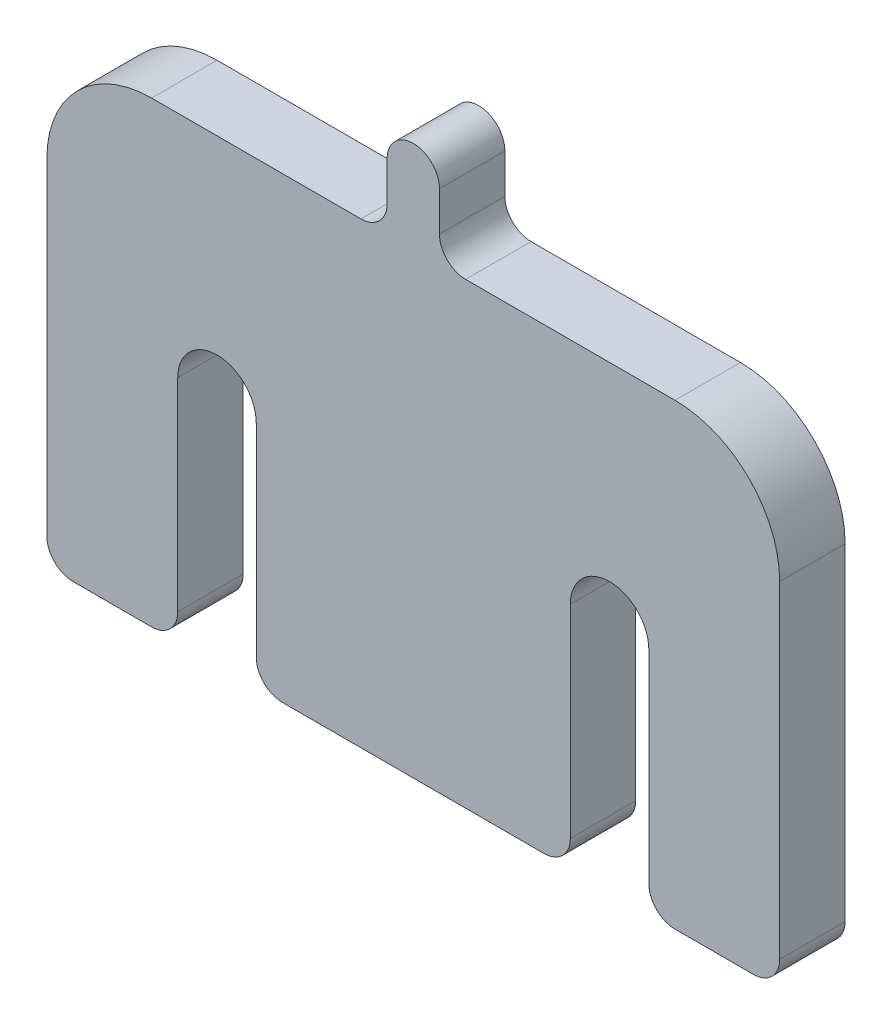
ISO-10303-21;
HEADER;
FILE_DESCRIPTION(('STEP AP214'),'2;1');
FILE_NAME('part.step','',(''),(''),'','','');
FILE_SCHEMA(('AUTOMOTIVE_DESIGN { 1 0 10303 214 1 1 1 1 }'));
ENDSEC;
DATA;
#1=APPLICATION_CONTEXT('core data for automotive mechanical design processes');
#2=APPLICATION_PROTOCOL_DEFINITION('international standard','automotive_design',2000,#1);
#3=PRODUCT_CONTEXT('',#1,'mechanical');
#4=PRODUCT('Part','Part','',(#3));
#5=PRODUCT_RELATED_PRODUCT_CATEGORY('part','',(#4));
#6=PRODUCT_DEFINITION_FORMATION('','',#4);
#7=PRODUCT_DEFINITION_CONTEXT('part definition',#1,'design');
#8=PRODUCT_DEFINITION('design','',#6,#7);
#9=PRODUCT_DEFINITION_SHAPE('','',#8);
#10=(LENGTH_UNIT() NAMED_UNIT(*) SI_UNIT(.MILLI.,.METRE.));
#11=(NAMED_UNIT(*) PLANE_ANGLE_UNIT() SI_UNIT($,.RADIAN.));
#12=(NAMED_UNIT(*) SI_UNIT($,.STERADIAN.) SOLID_ANGLE_UNIT());
#13=UNCERTAINTY_MEASURE_WITH_UNIT(LENGTH_MEASURE(1.E-05),#10,'distance_accuracy_value','');
#14=(GEOMETRIC_REPRESENTATION_CONTEXT(3) GLOBAL_UNCERTAINTY_ASSIGNED_CONTEXT((#13)) GLOBAL_UNIT_ASSIGNED_CONTEXT((#10,
#11,#12)) REPRESENTATION_CONTEXT('',''));
#15=CARTESIAN_POINT('',(0.,0.,0.));
#16=DIRECTION('',(0.,0.,1.));
#17=DIRECTION('',(1.,0.,0.));
#18=AXIS2_PLACEMENT_3D('',#15,#16,#17);
#19=CARTESIAN_POINT('',(15.,0.,5.));
#20=DIRECTION('',(0.,0.,-1.));
#21=DIRECTION('',(-1.,0.,0.));
#22=AXIS2_PLACEMENT_3D('',#19,#20,#21);
#23=CYLINDRICAL_SURFACE('',#22,3.);
#24=CARTESIAN_POINT('',(15.,0.,0.));
#25=DIRECTION('',(0.,0.,1.));
#26=DIRECTION('',(1.,0.,0.));
#27=AXIS2_PLACEMENT_3D('',#24,#25,#26);
#28=CIRCLE('',#27,3.);
#29=CARTESIAN_POINT('',(18.,0.,0.));
#30=VERTEX_POINT('',#29);
#31=CARTESIAN_POINT('',(12.,0.,0.));
#32=VERTEX_POINT('',#31);
#33=EDGE_CURVE('E215',#30,#32,#28,.T.);
#34=ORIENTED_EDGE('',*,*,#33,.F.);
#35=DIRECTION('',(0.,0.,-1.));
#36=VECTOR('',#35,1.);
#37=CARTESIAN_POINT('',(18.,0.,5.));
#38=LINE('',#37,#36);
#39=CARTESIAN_POINT('',(18.,0.,5.));
#40=VERTEX_POINT('',#39);
#41=EDGE_CURVE('E209',#40,#30,#38,.T.);
#42=ORIENTED_EDGE('',*,*,#41,.F.);
#43=CARTESIAN_POINT('',(15.,0.,5.));
#44=DIRECTION('',(0.,0.,1.));
#45=DIRECTION('',(1.,0.,0.));
#46=AXIS2_PLACEMENT_3D('',#43,#44,#45);
#47=CIRCLE('',#46,3.);
#48=CARTESIAN_POINT('',(12.,0.,5.));
#49=VERTEX_POINT('',#48);
#50=EDGE_CURVE('E212',#40,#49,#47,.T.);
#51=ORIENTED_EDGE('',*,*,#50,.T.);
#52=DIRECTION('',(0.,0.,-1.));
#53=VECTOR('',#52,1.);
#54=CARTESIAN_POINT('',(12.,0.,5.));
#55=LINE('',#54,#53);
#56=EDGE_CURVE('E270',#49,#32,#55,.T.);
#57=ORIENTED_EDGE('',*,*,#56,.T.);
#58=EDGE_LOOP('',(#34,#42,#51,#57));
#59=FACE_BOUND('',#58,.T.);
#60=ADVANCED_FACE('F36',(#59),#23,.F.);
#61=CARTESIAN_POINT('',(18.,0.,5.));
#62=DIRECTION('',(1.,0.,0.));
#63=DIRECTION('',(0.,1.,0.));
#64=AXIS2_PLACEMENT_3D('',#61,#62,#63);
#65=PLANE('',#64);
#66=DIRECTION('',(0.,-1.,0.));
#67=VECTOR('',#66,1.);
#68=CARTESIAN_POINT('',(18.,0.,0.));
#69=LINE('',#68,#67);
#70=CARTESIAN_POINT('',(18.,-15.5,0.));
#71=VERTEX_POINT('',#70);
#72=EDGE_CURVE('E272',#30,#71,#69,.T.);
#73=ORIENTED_EDGE('',*,*,#72,.T.);
#74=DIRECTION('',(0.,0.,-1.));
#75=VECTOR('',#74,1.);
#76=CARTESIAN_POINT('',(18.,-15.5,5.));
#77=LINE('',#76,#75);
#78=CARTESIAN_POINT('',(18.,-15.5,5.));
#79=VERTEX_POINT('',#78);
#80=EDGE_CURVE('E226',#71,#79,#77,.F.);
#81=ORIENTED_EDGE('',*,*,#80,.T.);
#82=DIRECTION('',(0.,-1.,0.));
#83=VECTOR('',#82,1.);
#84=CARTESIAN_POINT('',(18.,0.,5.));
#85=LINE('',#84,#83);
#86=EDGE_CURVE('E223',#40,#79,#85,.T.);
#87=ORIENTED_EDGE('',*,*,#86,.F.);
#88=ORIENTED_EDGE('',*,*,#41,.T.);
#89=EDGE_LOOP('',(#73,#81,#87,#88));
#90=FACE_BOUND('',#89,.T.);
#91=ADVANCED_FACE('F224',(#90),#65,.F.);
#92=CARTESIAN_POINT('',(0.,-17.5,5.));
#93=DIRECTION('',(0.,-1.,0.));
#94=DIRECTION('',(1.,0.,0.));
#95=AXIS2_PLACEMENT_3D('',#92,#93,#94);
#96=PLANE('',#95);
#97=DIRECTION('',(-1.,0.,0.));
#98=VECTOR('',#97,1.);
#99=CARTESIAN_POINT('',(0.,-17.5,5.));
#100=LINE('',#99,#98);
#101=CARTESIAN_POINT('',(26.,-17.5,5.));
#102=VERTEX_POINT('',#101);
#103=CARTESIAN_POINT('',(20.,-17.5,5.));
#104=VERTEX_POINT('',#103);
#105=EDGE_CURVE('E228',#102,#104,#100,.T.);
#106=ORIENTED_EDGE('',*,*,#105,.T.);
#107=DIRECTION('',(0.,0.,-1.));
#108=VECTOR('',#107,1.);
#109=CARTESIAN_POINT('',(20.,-17.5,0.));
#110=LINE('',#109,#108);
#111=CARTESIAN_POINT('',(20.,-17.5,0.));
#112=VERTEX_POINT('',#111);
#113=EDGE_CURVE('E366',#104,#112,#110,.T.);
#114=ORIENTED_EDGE('',*,*,#113,.T.);
#115=DIRECTION('',(-1.,0.,0.));
#116=VECTOR('',#115,1.);
#117=CARTESIAN_POINT('',(0.,-17.5,0.));
#118=LINE('',#117,#116);
#119=CARTESIAN_POINT('',(26.,-17.5,0.));
#120=VERTEX_POINT('',#119);
#121=EDGE_CURVE('E274',#120,#112,#118,.T.);
#122=ORIENTED_EDGE('',*,*,#121,.F.);
#123=DIRECTION('',(0.,0.,-1.));
#124=VECTOR('',#123,1.);
#125=CARTESIAN_POINT('',(26.,-17.5,5.));
#126=LINE('',#125,#124);
#127=EDGE_CURVE('E364',#120,#102,#126,.F.);
#128=ORIENTED_EDGE('',*,*,#127,.T.);
#129=EDGE_LOOP('',(#106,#114,#122,#128));
#130=FACE_BOUND('',#129,.T.);
#131=ADVANCED_FACE('F474',(#130),#96,.T.);
#132=CARTESIAN_POINT('',(28.,0.,5.));
#133=DIRECTION('',(-1.,0.,0.));
#134=DIRECTION('',(0.,0.,1.));
#135=AXIS2_PLACEMENT_3D('',#132,#133,#134);
#136=PLANE('',#135);
#137=DIRECTION('',(0.,1.,0.));
#138=VECTOR('',#137,1.);
#139=CARTESIAN_POINT('',(28.,0.,0.));
#140=LINE('',#139,#138);
#141=CARTESIAN_POINT('',(28.,-15.5,0.));
#142=VERTEX_POINT('',#141);
#143=CARTESIAN_POINT('',(28.,9.5,0.));
#144=VERTEX_POINT('',#143);
#145=EDGE_CURVE('E277',#142,#144,#140,.T.);
#146=ORIENTED_EDGE('',*,*,#145,.T.);
#147=DIRECTION('',(0.,0.,-1.));
#148=VECTOR('',#147,1.);
#149=CARTESIAN_POINT('',(28.,9.5,5.));
#150=LINE('',#149,#148);
#151=CARTESIAN_POINT('',(28.,9.5,5.));
#152=VERTEX_POINT('',#151);
#153=EDGE_CURVE('E11',#144,#152,#150,.F.);
#154=ORIENTED_EDGE('',*,*,#153,.T.);
#155=DIRECTION('',(0.,1.,0.));
#156=VECTOR('',#155,1.);
#157=CARTESIAN_POINT('',(28.,0.,5.));
#158=LINE('',#157,#156);
#159=CARTESIAN_POINT('',(28.,-15.5,5.));
#160=VERTEX_POINT('',#159);
#161=EDGE_CURVE('E245',#160,#152,#158,.T.);
#162=ORIENTED_EDGE('',*,*,#161,.F.);
#163=DIRECTION('',(0.,0.,-1.));
#164=VECTOR('',#163,1.);
#165=CARTESIAN_POINT('',(28.,-15.5,0.));
#166=LINE('',#165,#164);
#167=EDGE_CURVE('E372',#160,#142,#166,.T.);
#168=ORIENTED_EDGE('',*,*,#167,.T.);
#169=EDGE_LOOP('',(#146,#154,#162,#168));
#170=FACE_BOUND('',#169,.T.);
#171=ADVANCED_FACE('F480',(#170),#136,.F.);
#172=CARTESIAN_POINT('',(0.,17.5,5.));
#173=DIRECTION('',(0.,-1.,0.));
#174=DIRECTION('',(1.,0.,0.));
#175=AXIS2_PLACEMENT_3D('',#172,#173,#174);
#176=PLANE('',#175);
#177=DIRECTION('',(-1.,0.,0.));
#178=VECTOR('',#177,1.);
#179=CARTESIAN_POINT('',(0.,17.5,5.));
#180=LINE('',#179,#178);
#181=CARTESIAN_POINT('',(20.,17.5,5.));
#182=VERTEX_POINT('',#181);
#183=CARTESIAN_POINT('',(4.,17.5,5.));
#184=VERTEX_POINT('',#183);
#185=EDGE_CURVE('E247',#182,#184,#180,.T.);
#186=ORIENTED_EDGE('',*,*,#185,.F.);
#187=DIRECTION('',(0.,0.,-1.));
#188=VECTOR('',#187,1.);
#189=CARTESIAN_POINT('',(20.,17.5,5.));
#190=LINE('',#189,#188);
#191=CARTESIAN_POINT('',(20.,17.5,0.));
#192=VERTEX_POINT('',#191);
#193=EDGE_CURVE('E44',#182,#192,#190,.T.);
#194=ORIENTED_EDGE('',*,*,#193,.T.);
#195=DIRECTION('',(-1.,0.,0.));
#196=VECTOR('',#195,1.);
#197=CARTESIAN_POINT('',(0.,17.5,0.));
#198=LINE('',#197,#196);
#199=CARTESIAN_POINT('',(4.,17.5,0.));
#200=VERTEX_POINT('',#199);
#201=EDGE_CURVE('E280',#192,#200,#198,.T.);
#202=ORIENTED_EDGE('',*,*,#201,.T.);
#203=DIRECTION('',(0.,0.,-1.));
#204=VECTOR('',#203,1.);
#205=CARTESIAN_POINT('',(4.,17.5,5.));
#206=LINE('',#205,#204);
#207=EDGE_CURVE('E319',#200,#184,#206,.F.);
#208=ORIENTED_EDGE('',*,*,#207,.T.);
#209=EDGE_LOOP('',(#186,#194,#202,#208));
#210=FACE_BOUND('',#209,.T.);
#211=ADVANCED_FACE('F399',(#210),#176,.F.);
#212=CARTESIAN_POINT('',(2.,0.,5.));
#213=DIRECTION('',(1.,0.,0.));
#214=DIRECTION('',(0.,1.,0.));
#215=AXIS2_PLACEMENT_3D('',#212,#213,#214);
#216=PLANE('',#215);
#217=DIRECTION('',(0.,-1.,0.));
#218=VECTOR('',#217,1.);
#219=CARTESIAN_POINT('',(2.,0.,5.));
#220=LINE('',#219,#218);
#221=CARTESIAN_POINT('',(2.,22.5,5.));
#222=VERTEX_POINT('',#221);
#223=CARTESIAN_POINT('',(2.,19.5,5.));
#224=VERTEX_POINT('',#223);
#225=EDGE_CURVE('E249',#222,#224,#220,.T.);
#226=ORIENTED_EDGE('',*,*,#225,.T.);
#227=DIRECTION('',(0.,0.,-1.));
#228=VECTOR('',#227,1.);
#229=CARTESIAN_POINT('',(2.,19.5,5.));
#230=LINE('',#229,#228);
#231=CARTESIAN_POINT('',(2.,19.5,0.));
#232=VERTEX_POINT('',#231);
#233=EDGE_CURVE('E316',#224,#232,#230,.T.);
#234=ORIENTED_EDGE('',*,*,#233,.T.);
#235=DIRECTION('',(0.,-1.,0.));
#236=VECTOR('',#235,1.);
#237=CARTESIAN_POINT('',(2.,0.,0.));
#238=LINE('',#237,#236);
#239=CARTESIAN_POINT('',(2.,22.5,0.));
#240=VERTEX_POINT('',#239);
#241=EDGE_CURVE('E282',#240,#232,#238,.T.);
#242=ORIENTED_EDGE('',*,*,#241,.F.);
#243=DIRECTION('',(0.,0.,-1.));
#244=VECTOR('',#243,1.);
#245=CARTESIAN_POINT('',(2.,22.5,5.));
#246=LINE('',#245,#244);
#247=EDGE_CURVE('E220',#222,#240,#246,.T.);
#248=ORIENTED_EDGE('',*,*,#247,.F.);
#249=EDGE_LOOP('',(#226,#234,#242,#248));
#250=FACE_BOUND('',#249,.T.);
#251=ADVANCED_FACE('F413',(#250),#216,.T.);
#252=CARTESIAN_POINT('',(0.,22.5,5.));
#253=DIRECTION('',(0.,0.,-1.));
#254=DIRECTION('',(-1.,0.,0.));
#255=AXIS2_PLACEMENT_3D('',#252,#253,#254);
#256=CYLINDRICAL_SURFACE('',#255,2.);
#257=CARTESIAN_POINT('',(0.,22.5,0.));
#258=DIRECTION('',(0.,0.,1.));
#259=DIRECTION('',(1.,0.,0.));
#260=AXIS2_PLACEMENT_3D('',#257,#258,#259);
#261=CIRCLE('',#260,2.);
#262=CARTESIAN_POINT('',(-2.,22.5,0.));
#263=VERTEX_POINT('',#262);
#264=EDGE_CURVE('E286',#240,#263,#261,.T.);
#265=ORIENTED_EDGE('',*,*,#264,.T.);
#266=DIRECTION('',(0.,0.,-1.));
#267=VECTOR('',#266,1.);
#268=CARTESIAN_POINT('',(-2.,22.5,5.));
#269=LINE('',#268,#267);
#270=CARTESIAN_POINT('',(-2.,22.5,5.));
#271=VERTEX_POINT('',#270);
#272=EDGE_CURVE('E308',#271,#263,#269,.T.);
#273=ORIENTED_EDGE('',*,*,#272,.F.);
#274=CARTESIAN_POINT('',(0.,22.5,5.));
#275=DIRECTION('',(0.,0.,1.));
#276=DIRECTION('',(1.,0.,0.));
#277=AXIS2_PLACEMENT_3D('',#274,#275,#276);
#278=CIRCLE('',#277,2.);
#279=EDGE_CURVE('E253',#222,#271,#278,.T.);
#280=ORIENTED_EDGE('',*,*,#279,.F.);
#281=ORIENTED_EDGE('',*,*,#247,.T.);
#282=EDGE_LOOP('',(#265,#273,#280,#281));
#283=FACE_BOUND('',#282,.T.);
#284=ADVANCED_FACE('F417',(#283),#256,.T.);
#285=CARTESIAN_POINT('',(-2.,0.,5.));
#286=DIRECTION('',(1.,0.,0.));
#287=DIRECTION('',(0.,1.,0.));
#288=AXIS2_PLACEMENT_3D('',#285,#286,#287);
#289=PLANE('',#288);
#290=DIRECTION('',(0.,-1.,0.));
#291=VECTOR('',#290,1.);
#292=CARTESIAN_POINT('',(-2.,0.,0.));
#293=LINE('',#292,#291);
#294=CARTESIAN_POINT('',(-2.,19.5,0.));
#295=VERTEX_POINT('',#294);
#296=EDGE_CURVE('E288',#263,#295,#293,.T.);
#297=ORIENTED_EDGE('',*,*,#296,.T.);
#298=DIRECTION('',(0.,0.,-1.));
#299=VECTOR('',#298,1.);
#300=CARTESIAN_POINT('',(-2.,19.5,5.));
#301=LINE('',#300,#299);
#302=CARTESIAN_POINT('',(-2.,19.5,5.));
#303=VERTEX_POINT('',#302);
#304=EDGE_CURVE('E314',#295,#303,#301,.F.);
#305=ORIENTED_EDGE('',*,*,#304,.T.);
#306=DIRECTION('',(0.,-1.,0.));
#307=VECTOR('',#306,1.);
#308=CARTESIAN_POINT('',(-2.,0.,5.));
#309=LINE('',#308,#307);
#310=EDGE_CURVE('E255',#271,#303,#309,.T.);
#311=ORIENTED_EDGE('',*,*,#310,.F.);
#312=ORIENTED_EDGE('',*,*,#272,.T.);
#313=EDGE_LOOP('',(#297,#305,#311,#312));
#314=FACE_BOUND('',#313,.T.);
#315=ADVANCED_FACE('F565',(#314),#289,.F.);
#316=CARTESIAN_POINT('',(-4.,17.5,0.));
#317=VERTEX_POINT('',#316);
#318=CARTESIAN_POINT('',(-20.,17.5,0.));
#319=VERTEX_POINT('',#318);
#320=EDGE_CURVE('E283',#317,#319,#198,.T.);
#321=ORIENTED_EDGE('',*,*,#320,.T.);
#322=DIRECTION('',(0.,0.,-1.));
#323=VECTOR('',#322,1.);
#324=CARTESIAN_POINT('',(-20.,17.5,5.));
#325=LINE('',#324,#323);
#326=CARTESIAN_POINT('',(-20.,17.5,5.));
#327=VERTEX_POINT('',#326);
#328=EDGE_CURVE('E391',#319,#327,#325,.F.);
#329=ORIENTED_EDGE('',*,*,#328,.T.);
#330=CARTESIAN_POINT('',(-4.,17.5,5.));
#331=VERTEX_POINT('',#330);
#332=EDGE_CURVE('E250',#331,#327,#180,.T.);
#333=ORIENTED_EDGE('',*,*,#332,.F.);
#334=DIRECTION('',(0.,0.,-1.));
#335=VECTOR('',#334,1.);
#336=CARTESIAN_POINT('',(-4.,17.5,0.));
#337=LINE('',#336,#335);
#338=EDGE_CURVE('E219',#331,#317,#337,.T.);
#339=ORIENTED_EDGE('',*,*,#338,.T.);
#340=EDGE_LOOP('',(#321,#329,#333,#339));
#341=FACE_BOUND('',#340,.T.);
#342=ADVANCED_FACE('F429',(#341),#176,.F.);
#343=CARTESIAN_POINT('',(-28.,0.,5.));
#344=DIRECTION('',(-1.,0.,0.));
#345=DIRECTION('',(0.,0.,1.));
#346=AXIS2_PLACEMENT_3D('',#343,#344,#345);
#347=PLANE('',#346);
#348=DIRECTION('',(0.,1.,0.));
#349=VECTOR('',#348,1.);
#350=CARTESIAN_POINT('',(-28.,0.,5.));
#351=LINE('',#350,#349);
#352=CARTESIAN_POINT('',(-28.,-15.5,5.));
#353=VERTEX_POINT('',#352);
#354=CARTESIAN_POINT('',(-28.,9.5,5.));
#355=VERTEX_POINT('',#354);
#356=EDGE_CURVE('E258',#353,#355,#351,.T.);
#357=ORIENTED_EDGE('',*,*,#356,.T.);
#358=DIRECTION('',(0.,0.,-1.));
#359=VECTOR('',#358,1.);
#360=CARTESIAN_POINT('',(-28.,9.5,0.));
#361=LINE('',#360,#359);
#362=CARTESIAN_POINT('',(-28.,9.5,0.));
#363=VERTEX_POINT('',#362);
#364=EDGE_CURVE('E384',#355,#363,#361,.T.);
#365=ORIENTED_EDGE('',*,*,#364,.T.);
#366=DIRECTION('',(0.,1.,0.));
#367=VECTOR('',#366,1.);
#368=CARTESIAN_POINT('',(-28.,0.,0.));
#369=LINE('',#368,#367);
#370=CARTESIAN_POINT('',(-28.,-15.5,0.));
#371=VERTEX_POINT('',#370);
#372=EDGE_CURVE('E291',#371,#363,#369,.T.);
#373=ORIENTED_EDGE('',*,*,#372,.F.);
#374=DIRECTION('',(0.,0.,-1.));
#375=VECTOR('',#374,1.);
#376=CARTESIAN_POINT('',(-28.,-15.5,5.));
#377=LINE('',#376,#375);
#378=EDGE_CURVE('E370',#371,#353,#377,.F.);
#379=ORIENTED_EDGE('',*,*,#378,.T.);
#380=EDGE_LOOP('',(#357,#365,#373,#379));
#381=FACE_BOUND('',#380,.T.);
#382=ADVANCED_FACE('F438',(#381),#347,.T.);
#383=CARTESIAN_POINT('',(-20.,-17.5,0.));
#384=VERTEX_POINT('',#383);
#385=CARTESIAN_POINT('',(-26.,-17.5,0.));
#386=VERTEX_POINT('',#385);
#387=EDGE_CURVE('E278',#384,#386,#118,.T.);
#388=ORIENTED_EDGE('',*,*,#387,.F.);
#389=DIRECTION('',(0.,0.,-1.));
#390=VECTOR('',#389,1.);
#391=CARTESIAN_POINT('',(-20.,-17.5,5.));
#392=LINE('',#391,#390);
#393=CARTESIAN_POINT('',(-20.,-17.5,5.));
#394=VERTEX_POINT('',#393);
#395=EDGE_CURVE('E340',#384,#394,#392,.F.);
#396=ORIENTED_EDGE('',*,*,#395,.T.);
#397=CARTESIAN_POINT('',(-26.,-17.5,5.));
#398=VERTEX_POINT('',#397);
#399=EDGE_CURVE('E244',#394,#398,#100,.T.);
#400=ORIENTED_EDGE('',*,*,#399,.T.);
#401=DIRECTION('',(0.,0.,-1.));
#402=VECTOR('',#401,1.);
#403=CARTESIAN_POINT('',(-26.,-17.5,5.));
#404=LINE('',#403,#402);
#405=EDGE_CURVE('E337',#398,#386,#404,.T.);
#406=ORIENTED_EDGE('',*,*,#405,.T.);
#407=EDGE_LOOP('',(#388,#396,#400,#406));
#408=FACE_BOUND('',#407,.T.);
#409=ADVANCED_FACE('F450',(#408),#96,.T.);
#410=CARTESIAN_POINT('',(-18.,0.,5.));
#411=DIRECTION('',(1.,0.,0.));
#412=DIRECTION('',(0.,1.,0.));
#413=AXIS2_PLACEMENT_3D('',#410,#411,#412);
#414=PLANE('',#413);
#415=DIRECTION('',(0.,-1.,0.));
#416=VECTOR('',#415,1.);
#417=CARTESIAN_POINT('',(-18.,0.,5.));
#418=LINE('',#417,#416);
#419=CARTESIAN_POINT('',(-18.,0.,5.));
#420=VERTEX_POINT('',#419);
#421=CARTESIAN_POINT('',(-18.,-15.5,5.));
#422=VERTEX_POINT('',#421);
#423=EDGE_CURVE('E261',#420,#422,#418,.T.);
#424=ORIENTED_EDGE('',*,*,#423,.T.);
#425=DIRECTION('',(0.,0.,-1.));
#426=VECTOR('',#425,1.);
#427=CARTESIAN_POINT('',(-18.,-15.5,5.));
#428=LINE('',#427,#426);
#429=CARTESIAN_POINT('',(-18.,-15.5,0.));
#430=VERTEX_POINT('',#429);
#431=EDGE_CURVE('E322',#422,#430,#428,.T.);
#432=ORIENTED_EDGE('',*,*,#431,.T.);
#433=DIRECTION('',(0.,-1.,0.));
#434=VECTOR('',#433,1.);
#435=CARTESIAN_POINT('',(-18.,0.,0.));
#436=LINE('',#435,#434);
#437=CARTESIAN_POINT('',(-18.,0.,0.));
#438=VERTEX_POINT('',#437);
#439=EDGE_CURVE('E294',#438,#430,#436,.T.);
#440=ORIENTED_EDGE('',*,*,#439,.F.);
#441=DIRECTION('',(0.,0.,-1.));
#442=VECTOR('',#441,1.);
#443=CARTESIAN_POINT('',(-18.,0.,5.));
#444=LINE('',#443,#442);
#445=EDGE_CURVE('E306',#420,#438,#444,.T.);
#446=ORIENTED_EDGE('',*,*,#445,.F.);
#447=EDGE_LOOP('',(#424,#432,#440,#446));
#448=FACE_BOUND('',#447,.T.);
#449=ADVANCED_FACE('F607',(#448),#414,.T.);
#450=CARTESIAN_POINT('',(-15.,0.,5.));
#451=DIRECTION('',(0.,0.,-1.));
#452=DIRECTION('',(-1.,0.,0.));
#453=AXIS2_PLACEMENT_3D('',#450,#451,#452);
#454=CYLINDRICAL_SURFACE('',#453,3.);
#455=CARTESIAN_POINT('',(-15.,0.,0.));
#456=DIRECTION('',(0.,0.,1.));
#457=DIRECTION('',(1.,0.,0.));
#458=AXIS2_PLACEMENT_3D('',#455,#456,#457);
#459=CIRCLE('',#458,3.);
#460=CARTESIAN_POINT('',(-12.,0.,0.));
#461=VERTEX_POINT('',#460);
#462=EDGE_CURVE('E297',#461,#438,#459,.T.);
#463=ORIENTED_EDGE('',*,*,#462,.F.);
#464=DIRECTION('',(0.,0.,-1.));
#465=VECTOR('',#464,1.);
#466=CARTESIAN_POINT('',(-12.,0.,5.));
#467=LINE('',#466,#465);
#468=CARTESIAN_POINT('',(-12.,0.,5.));
#469=VERTEX_POINT('',#468);
#470=EDGE_CURVE('E304',#469,#461,#467,.T.);
#471=ORIENTED_EDGE('',*,*,#470,.F.);
#472=CARTESIAN_POINT('',(-15.,0.,5.));
#473=DIRECTION('',(0.,0.,1.));
#474=DIRECTION('',(1.,0.,0.));
#475=AXIS2_PLACEMENT_3D('',#472,#473,#474);
#476=CIRCLE('',#475,3.);
#477=EDGE_CURVE('E264',#469,#420,#476,.T.);
#478=ORIENTED_EDGE('',*,*,#477,.T.);
#479=ORIENTED_EDGE('',*,*,#445,.T.);
#480=EDGE_LOOP('',(#463,#471,#478,#479));
#481=FACE_BOUND('',#480,.T.);
#482=ADVANCED_FACE('F601',(#481),#454,.F.);
#483=CARTESIAN_POINT('',(-12.,0.,5.));
#484=DIRECTION('',(1.,0.,0.));
#485=DIRECTION('',(0.,1.,0.));
#486=AXIS2_PLACEMENT_3D('',#483,#484,#485);
#487=PLANE('',#486);
#488=DIRECTION('',(0.,-1.,0.));
#489=VECTOR('',#488,1.);
#490=CARTESIAN_POINT('',(-12.,0.,0.));
#491=LINE('',#490,#489);
#492=CARTESIAN_POINT('',(-12.,-15.5,0.));
#493=VERTEX_POINT('',#492);
#494=EDGE_CURVE('E300',#461,#493,#491,.T.);
#495=ORIENTED_EDGE('',*,*,#494,.T.);
#496=DIRECTION('',(0.,0.,-1.));
#497=VECTOR('',#496,1.);
#498=CARTESIAN_POINT('',(-12.,-15.5,5.));
#499=LINE('',#498,#497);
#500=CARTESIAN_POINT('',(-12.,-15.5,5.));
#501=VERTEX_POINT('',#500);
#502=EDGE_CURVE('E359',#493,#501,#499,.F.);
#503=ORIENTED_EDGE('',*,*,#502,.T.);
#504=DIRECTION('',(0.,-1.,0.));
#505=VECTOR('',#504,1.);
#506=CARTESIAN_POINT('',(-12.,0.,5.));
#507=LINE('',#506,#505);
#508=EDGE_CURVE('E243',#469,#501,#507,.T.);
#509=ORIENTED_EDGE('',*,*,#508,.F.);
#510=ORIENTED_EDGE('',*,*,#470,.T.);
#511=EDGE_LOOP('',(#495,#503,#509,#510));
#512=FACE_BOUND('',#511,.T.);
#513=ADVANCED_FACE('F606',(#512),#487,.F.);
#514=CARTESIAN_POINT('',(10.,-17.5,5.));
#515=VERTEX_POINT('',#514);
#516=CARTESIAN_POINT('',(-10.,-17.5,5.));
#517=VERTEX_POINT('',#516);
#518=EDGE_CURVE('E240',#515,#517,#100,.T.);
#519=ORIENTED_EDGE('',*,*,#518,.T.);
#520=DIRECTION('',(0.,0.,-1.));
#521=VECTOR('',#520,1.);
#522=CARTESIAN_POINT('',(-10.,-17.5,0.));
#523=LINE('',#522,#521);
#524=CARTESIAN_POINT('',(-10.,-17.5,0.));
#525=VERTEX_POINT('',#524);
#526=EDGE_CURVE('E356',#517,#525,#523,.T.);
#527=ORIENTED_EDGE('',*,*,#526,.T.);
#528=CARTESIAN_POINT('',(10.,-17.5,0.));
#529=VERTEX_POINT('',#528);
#530=EDGE_CURVE('E237',#529,#525,#118,.T.);
#531=ORIENTED_EDGE('',*,*,#530,.F.);
#532=DIRECTION('',(0.,0.,-1.));
#533=VECTOR('',#532,1.);
#534=CARTESIAN_POINT('',(10.,-17.5,5.));
#535=LINE('',#534,#533);
#536=EDGE_CURVE('E354',#529,#515,#535,.F.);
#537=ORIENTED_EDGE('',*,*,#536,.T.);
#538=EDGE_LOOP('',(#519,#527,#531,#537));
#539=FACE_BOUND('',#538,.T.);
#540=ADVANCED_FACE('F457',(#539),#96,.T.);
#541=CARTESIAN_POINT('',(12.,0.,5.));
#542=DIRECTION('',(1.,0.,0.));
#543=DIRECTION('',(0.,1.,0.));
#544=AXIS2_PLACEMENT_3D('',#541,#542,#543);
#545=PLANE('',#544);
#546=DIRECTION('',(0.,-1.,0.));
#547=VECTOR('',#546,1.);
#548=CARTESIAN_POINT('',(12.,0.,5.));
#549=LINE('',#548,#547);
#550=CARTESIAN_POINT('',(12.,-15.5,5.));
#551=VERTEX_POINT('',#550);
#552=EDGE_CURVE('E233',#49,#551,#549,.T.);
#553=ORIENTED_EDGE('',*,*,#552,.T.);
#554=DIRECTION('',(0.,0.,-1.));
#555=VECTOR('',#554,1.);
#556=CARTESIAN_POINT('',(12.,-15.5,5.));
#557=LINE('',#556,#555);
#558=CARTESIAN_POINT('',(12.,-15.5,0.));
#559=VERTEX_POINT('',#558);
#560=EDGE_CURVE('E361',#551,#559,#557,.T.);
#561=ORIENTED_EDGE('',*,*,#560,.T.);
#562=DIRECTION('',(0.,-1.,0.));
#563=VECTOR('',#562,1.);
#564=CARTESIAN_POINT('',(12.,0.,0.));
#565=LINE('',#564,#563);
#566=EDGE_CURVE('E234',#32,#559,#565,.T.);
#567=ORIENTED_EDGE('',*,*,#566,.F.);
#568=ORIENTED_EDGE('',*,*,#56,.F.);
#569=EDGE_LOOP('',(#553,#561,#567,#568));
#570=FACE_BOUND('',#569,.T.);
#571=ADVANCED_FACE('F465',(#570),#545,.T.);
#572=CARTESIAN_POINT('',(0.,0.,5.));
#573=DIRECTION('',(0.,0.,1.));
#574=DIRECTION('',(1.,0.,0.));
#575=AXIS2_PLACEMENT_3D('',#572,#573,#574);
#576=PLANE('',#575);
#577=ORIENTED_EDGE('',*,*,#332,.T.);
#578=CARTESIAN_POINT('',(-20.,9.5,5.));
#579=DIRECTION('',(0.,0.,1.));
#580=DIRECTION('',(1.,0.,0.));
#581=AXIS2_PLACEMENT_3D('',#578,#579,#580);
#582=CIRCLE('',#581,8.);
#583=EDGE_CURVE('E394',#327,#355,#582,.T.);
#584=ORIENTED_EDGE('',*,*,#583,.T.);
#585=ORIENTED_EDGE('',*,*,#356,.F.);
#586=CARTESIAN_POINT('',(-26.,-15.5,5.));
#587=DIRECTION('',(0.,0.,1.));
#588=DIRECTION('',(1.,0.,0.));
#589=AXIS2_PLACEMENT_3D('',#586,#587,#588);
#590=CIRCLE('',#589,2.);
#591=EDGE_CURVE('E344',#353,#398,#590,.T.);
#592=ORIENTED_EDGE('',*,*,#591,.T.);
#593=ORIENTED_EDGE('',*,*,#399,.F.);
#594=CARTESIAN_POINT('',(-20.,-15.5,5.));
#595=DIRECTION('',(0.,0.,1.));
#596=DIRECTION('',(1.,0.,0.));
#597=AXIS2_PLACEMENT_3D('',#594,#595,#596);
#598=CIRCLE('',#597,2.);
#599=EDGE_CURVE('E352',#394,#422,#598,.T.);
#600=ORIENTED_EDGE('',*,*,#599,.T.);
#601=ORIENTED_EDGE('',*,*,#423,.F.);
#602=ORIENTED_EDGE('',*,*,#477,.F.);
#603=ORIENTED_EDGE('',*,*,#508,.T.);
#604=CARTESIAN_POINT('',(-10.,-15.5,5.));
#605=DIRECTION('',(0.,0.,1.));
#606=DIRECTION('',(1.,0.,0.));
#607=AXIS2_PLACEMENT_3D('',#604,#605,#606);
#608=CIRCLE('',#607,2.);
#609=EDGE_CURVE('E350',#501,#517,#608,.T.);
#610=ORIENTED_EDGE('',*,*,#609,.T.);
#611=ORIENTED_EDGE('',*,*,#518,.F.);
#612=CARTESIAN_POINT('',(10.,-15.5,5.));
#613=DIRECTION('',(0.,0.,1.));
#614=DIRECTION('',(1.,0.,0.));
#615=AXIS2_PLACEMENT_3D('',#612,#613,#614);
#616=CIRCLE('',#615,2.);
#617=EDGE_CURVE('E348',#515,#551,#616,.T.);
#618=ORIENTED_EDGE('',*,*,#617,.T.);
#619=ORIENTED_EDGE('',*,*,#552,.F.);
#620=ORIENTED_EDGE('',*,*,#50,.F.);
#621=ORIENTED_EDGE('',*,*,#86,.T.);
#622=CARTESIAN_POINT('',(20.,-15.5,5.));
#623=DIRECTION('',(0.,0.,1.));
#624=DIRECTION('',(1.,0.,0.));
#625=AXIS2_PLACEMENT_3D('',#622,#623,#624);
#626=CIRCLE('',#625,2.);
#627=EDGE_CURVE('E346',#79,#104,#626,.T.);
#628=ORIENTED_EDGE('',*,*,#627,.T.);
#629=ORIENTED_EDGE('',*,*,#105,.F.);
#630=CARTESIAN_POINT('',(26.,-15.5,5.));
#631=DIRECTION('',(0.,0.,1.));
#632=DIRECTION('',(1.,0.,0.));
#633=AXIS2_PLACEMENT_3D('',#630,#631,#632);
#634=CIRCLE('',#633,2.);
#635=EDGE_CURVE('E342',#102,#160,#634,.T.);
#636=ORIENTED_EDGE('',*,*,#635,.T.);
#637=ORIENTED_EDGE('',*,*,#161,.T.);
#638=CARTESIAN_POINT('',(20.,9.5,5.));
#639=DIRECTION('',(0.,0.,1.));
#640=DIRECTION('',(1.,0.,0.));
#641=AXIS2_PLACEMENT_3D('',#638,#639,#640);
#642=CIRCLE('',#641,8.);
#643=EDGE_CURVE('E51',#152,#182,#642,.T.);
#644=ORIENTED_EDGE('',*,*,#643,.T.);
#645=ORIENTED_EDGE('',*,*,#185,.T.);
#646=CARTESIAN_POINT('',(4.,19.5,5.));
#647=DIRECTION('',(0.,0.,1.));
#648=DIRECTION('',(1.,0.,0.));
#649=AXIS2_PLACEMENT_3D('',#646,#647,#648);
#650=CIRCLE('',#649,2.);
#651=EDGE_CURVE('E382',#184,#224,#650,.F.);
#652=ORIENTED_EDGE('',*,*,#651,.T.);
#653=ORIENTED_EDGE('',*,*,#225,.F.);
#654=ORIENTED_EDGE('',*,*,#279,.T.);
#655=ORIENTED_EDGE('',*,*,#310,.T.);
#656=CARTESIAN_POINT('',(-4.,19.5,5.));
#657=DIRECTION('',(0.,0.,1.));
#658=DIRECTION('',(1.,0.,0.));
#659=AXIS2_PLACEMENT_3D('',#656,#657,#658);
#660=CIRCLE('',#659,2.);
#661=EDGE_CURVE('E377',#303,#331,#660,.F.);
#662=ORIENTED_EDGE('',*,*,#661,.T.);
#663=EDGE_LOOP('',(#577,#584,#585,#592,#593,#600,#601,#602,#603,#610,#611,#618,#619,#620,#621,
#628,#629,#636,#637,#644,#645,#652,#653,#654,#655,#662));
#664=FACE_BOUND('',#663,.T.);
#665=ADVANCED_FACE('F231',(#664),#576,.T.);
#666=CARTESIAN_POINT('',(0.,0.,0.));
#667=DIRECTION('',(0.,0.,1.));
#668=DIRECTION('',(1.,0.,0.));
#669=AXIS2_PLACEMENT_3D('',#666,#667,#668);
#670=PLANE('',#669);
#671=ORIENTED_EDGE('',*,*,#372,.T.);
#672=CARTESIAN_POINT('',(-20.,9.5,0.));
#673=DIRECTION('',(0.,0.,1.));
#674=DIRECTION('',(1.,0.,0.));
#675=AXIS2_PLACEMENT_3D('',#672,#673,#674);
#676=CIRCLE('',#675,8.);
#677=EDGE_CURVE('E389',#363,#319,#676,.F.);
#678=ORIENTED_EDGE('',*,*,#677,.T.);
#679=ORIENTED_EDGE('',*,*,#320,.F.);
#680=CARTESIAN_POINT('',(-4.,19.5,0.));
#681=DIRECTION('',(0.,0.,1.));
#682=DIRECTION('',(1.,0.,0.));
#683=AXIS2_PLACEMENT_3D('',#680,#681,#682);
#684=CIRCLE('',#683,2.);
#685=EDGE_CURVE('E375',#317,#295,#684,.T.);
#686=ORIENTED_EDGE('',*,*,#685,.T.);
#687=ORIENTED_EDGE('',*,*,#296,.F.);
#688=ORIENTED_EDGE('',*,*,#264,.F.);
#689=ORIENTED_EDGE('',*,*,#241,.T.);
#690=CARTESIAN_POINT('',(4.,19.5,0.));
#691=DIRECTION('',(0.,0.,1.));
#692=DIRECTION('',(1.,0.,0.));
#693=AXIS2_PLACEMENT_3D('',#690,#691,#692);
#694=CIRCLE('',#693,2.);
#695=EDGE_CURVE('E379',#232,#200,#694,.T.);
#696=ORIENTED_EDGE('',*,*,#695,.T.);
#697=ORIENTED_EDGE('',*,*,#201,.F.);
#698=CARTESIAN_POINT('',(20.,9.5,0.));
#699=DIRECTION('',(0.,0.,1.));
#700=DIRECTION('',(1.,0.,0.));
#701=AXIS2_PLACEMENT_3D('',#698,#699,#700);
#702=CIRCLE('',#701,8.);
#703=EDGE_CURVE('E387',#192,#144,#702,.F.);
#704=ORIENTED_EDGE('',*,*,#703,.T.);
#705=ORIENTED_EDGE('',*,*,#145,.F.);
#706=CARTESIAN_POINT('',(26.,-15.5,0.));
#707=DIRECTION('',(0.,0.,1.));
#708=DIRECTION('',(1.,0.,0.));
#709=AXIS2_PLACEMENT_3D('',#706,#707,#708);
#710=CIRCLE('',#709,2.);
#711=EDGE_CURVE('E325',#142,#120,#710,.F.);
#712=ORIENTED_EDGE('',*,*,#711,.T.);
#713=ORIENTED_EDGE('',*,*,#121,.T.);
#714=CARTESIAN_POINT('',(20.,-15.5,0.));
#715=DIRECTION('',(0.,0.,1.));
#716=DIRECTION('',(1.,0.,0.));
#717=AXIS2_PLACEMENT_3D('',#714,#715,#716);
#718=CIRCLE('',#717,2.);
#719=EDGE_CURVE('E329',#112,#71,#718,.F.);
#720=ORIENTED_EDGE('',*,*,#719,.T.);
#721=ORIENTED_EDGE('',*,*,#72,.F.);
#722=ORIENTED_EDGE('',*,*,#33,.T.);
#723=ORIENTED_EDGE('',*,*,#566,.T.);
#724=CARTESIAN_POINT('',(10.,-15.5,0.));
#725=DIRECTION('',(0.,0.,1.));
#726=DIRECTION('',(1.,0.,0.));
#727=AXIS2_PLACEMENT_3D('',#724,#725,#726);
#728=CIRCLE('',#727,2.);
#729=EDGE_CURVE('E331',#559,#529,#728,.F.);
#730=ORIENTED_EDGE('',*,*,#729,.T.);
#731=ORIENTED_EDGE('',*,*,#530,.T.);
#732=CARTESIAN_POINT('',(-10.,-15.5,0.));
#733=DIRECTION('',(0.,0.,1.));
#734=DIRECTION('',(1.,0.,0.));
#735=AXIS2_PLACEMENT_3D('',#732,#733,#734);
#736=CIRCLE('',#735,2.);
#737=EDGE_CURVE('E333',#525,#493,#736,.F.);
#738=ORIENTED_EDGE('',*,*,#737,.T.);
#739=ORIENTED_EDGE('',*,*,#494,.F.);
#740=ORIENTED_EDGE('',*,*,#462,.T.);
#741=ORIENTED_EDGE('',*,*,#439,.T.);
#742=CARTESIAN_POINT('',(-20.,-15.5,0.));
#743=DIRECTION('',(0.,0.,1.));
#744=DIRECTION('',(1.,0.,0.));
#745=AXIS2_PLACEMENT_3D('',#742,#743,#744);
#746=CIRCLE('',#745,2.);
#747=EDGE_CURVE('E335',#430,#384,#746,.F.);
#748=ORIENTED_EDGE('',*,*,#747,.T.);
#749=ORIENTED_EDGE('',*,*,#387,.T.);
#750=CARTESIAN_POINT('',(-26.,-15.5,0.));
#751=DIRECTION('',(0.,0.,1.));
#752=DIRECTION('',(1.,0.,0.));
#753=AXIS2_PLACEMENT_3D('',#750,#751,#752);
#754=CIRCLE('',#753,2.);
#755=EDGE_CURVE('E327',#386,#371,#754,.F.);
#756=ORIENTED_EDGE('',*,*,#755,.T.);
#757=EDGE_LOOP('',(#671,#678,#679,#686,#687,#688,#689,#696,#697,#704,#705,#712,#713,#720,#721,
#722,#723,#730,#731,#738,#739,#740,#741,#748,#749,#756));
#758=FACE_BOUND('',#757,.T.);
#759=ADVANCED_FACE('F402',(#758),#670,.F.);
#760=CARTESIAN_POINT('',(-4.,19.5,5.));
#761=DIRECTION('',(0.,0.,1.));
#762=DIRECTION('',(1.,0.,0.));
#763=AXIS2_PLACEMENT_3D('',#760,#761,#762);
#764=CYLINDRICAL_SURFACE('',#763,2.);
#765=ORIENTED_EDGE('',*,*,#661,.F.);
#766=ORIENTED_EDGE('',*,*,#304,.F.);
#767=ORIENTED_EDGE('',*,*,#685,.F.);
#768=ORIENTED_EDGE('',*,*,#338,.F.);
#769=EDGE_LOOP('',(#765,#766,#767,#768));
#770=FACE_BOUND('',#769,.T.);
#771=ADVANCED_FACE('F425',(#770),#764,.F.);
#772=CARTESIAN_POINT('',(4.,19.5,5.));
#773=DIRECTION('',(0.,0.,-1.));
#774=DIRECTION('',(-1.,0.,0.));
#775=AXIS2_PLACEMENT_3D('',#772,#773,#774);
#776=CYLINDRICAL_SURFACE('',#775,2.);
#777=ORIENTED_EDGE('',*,*,#651,.F.);
#778=ORIENTED_EDGE('',*,*,#207,.F.);
#779=ORIENTED_EDGE('',*,*,#695,.F.);
#780=ORIENTED_EDGE('',*,*,#233,.F.);
#781=EDGE_LOOP('',(#777,#778,#779,#780));
#782=FACE_BOUND('',#781,.T.);
#783=ADVANCED_FACE('F410',(#782),#776,.F.);
#784=CARTESIAN_POINT('',(-20.,-15.5,5.));
#785=DIRECTION('',(0.,0.,-1.));
#786=DIRECTION('',(-1.,0.,0.));
#787=AXIS2_PLACEMENT_3D('',#784,#785,#786);
#788=CYLINDRICAL_SURFACE('',#787,2.);
#789=ORIENTED_EDGE('',*,*,#599,.F.);
#790=ORIENTED_EDGE('',*,*,#395,.F.);
#791=ORIENTED_EDGE('',*,*,#747,.F.);
#792=ORIENTED_EDGE('',*,*,#431,.F.);
#793=EDGE_LOOP('',(#789,#790,#791,#792));
#794=FACE_BOUND('',#793,.T.);
#795=ADVANCED_FACE('F497',(#794),#788,.T.);
#796=CARTESIAN_POINT('',(-10.,-15.5,5.));
#797=DIRECTION('',(0.,0.,1.));
#798=DIRECTION('',(1.,0.,0.));
#799=AXIS2_PLACEMENT_3D('',#796,#797,#798);
#800=CYLINDRICAL_SURFACE('',#799,2.);
#801=ORIENTED_EDGE('',*,*,#609,.F.);
#802=ORIENTED_EDGE('',*,*,#502,.F.);
#803=ORIENTED_EDGE('',*,*,#737,.F.);
#804=ORIENTED_EDGE('',*,*,#526,.F.);
#805=EDGE_LOOP('',(#801,#802,#803,#804));
#806=FACE_BOUND('',#805,.T.);
#807=ADVANCED_FACE('F500',(#806),#800,.T.);
#808=CARTESIAN_POINT('',(10.,-15.5,5.));
#809=DIRECTION('',(0.,0.,-1.));
#810=DIRECTION('',(-1.,0.,0.));
#811=AXIS2_PLACEMENT_3D('',#808,#809,#810);
#812=CYLINDRICAL_SURFACE('',#811,2.);
#813=ORIENTED_EDGE('',*,*,#617,.F.);
#814=ORIENTED_EDGE('',*,*,#536,.F.);
#815=ORIENTED_EDGE('',*,*,#729,.F.);
#816=ORIENTED_EDGE('',*,*,#560,.F.);
#817=EDGE_LOOP('',(#813,#814,#815,#816));
#818=FACE_BOUND('',#817,.T.);
#819=ADVANCED_FACE('F462',(#818),#812,.T.);
#820=CARTESIAN_POINT('',(20.,-15.5,5.));
#821=DIRECTION('',(0.,0.,1.));
#822=DIRECTION('',(1.,0.,0.));
#823=AXIS2_PLACEMENT_3D('',#820,#821,#822);
#824=CYLINDRICAL_SURFACE('',#823,2.);
#825=ORIENTED_EDGE('',*,*,#627,.F.);
#826=ORIENTED_EDGE('',*,*,#80,.F.);
#827=ORIENTED_EDGE('',*,*,#719,.F.);
#828=ORIENTED_EDGE('',*,*,#113,.F.);
#829=EDGE_LOOP('',(#825,#826,#827,#828));
#830=FACE_BOUND('',#829,.T.);
#831=ADVANCED_FACE('F468',(#830),#824,.T.);
#832=CARTESIAN_POINT('',(-26.,-15.5,5.));
#833=DIRECTION('',(0.,0.,-1.));
#834=DIRECTION('',(-1.,0.,0.));
#835=AXIS2_PLACEMENT_3D('',#832,#833,#834);
#836=CYLINDRICAL_SURFACE('',#835,2.);
#837=ORIENTED_EDGE('',*,*,#591,.F.);
#838=ORIENTED_EDGE('',*,*,#378,.F.);
#839=ORIENTED_EDGE('',*,*,#755,.F.);
#840=ORIENTED_EDGE('',*,*,#405,.F.);
#841=EDGE_LOOP('',(#837,#838,#839,#840));
#842=FACE_BOUND('',#841,.T.);
#843=ADVANCED_FACE('F446',(#842),#836,.T.);
#844=CARTESIAN_POINT('',(26.,-15.5,5.));
#845=DIRECTION('',(0.,0.,1.));
#846=DIRECTION('',(1.,0.,0.));
#847=AXIS2_PLACEMENT_3D('',#844,#845,#846);
#848=CYLINDRICAL_SURFACE('',#847,2.);
#849=ORIENTED_EDGE('',*,*,#635,.F.);
#850=ORIENTED_EDGE('',*,*,#127,.F.);
#851=ORIENTED_EDGE('',*,*,#711,.F.);
#852=ORIENTED_EDGE('',*,*,#167,.F.);
#853=EDGE_LOOP('',(#849,#850,#851,#852));
#854=FACE_BOUND('',#853,.T.);
#855=ADVANCED_FACE('F478',(#854),#848,.T.);
#856=CARTESIAN_POINT('',(-20.,9.5,5.));
#857=DIRECTION('',(0.,0.,1.));
#858=DIRECTION('',(1.,0.,0.));
#859=AXIS2_PLACEMENT_3D('',#856,#857,#858);
#860=CYLINDRICAL_SURFACE('',#859,8.);
#861=ORIENTED_EDGE('',*,*,#583,.F.);
#862=ORIENTED_EDGE('',*,*,#328,.F.);
#863=ORIENTED_EDGE('',*,*,#677,.F.);
#864=ORIENTED_EDGE('',*,*,#364,.F.);
#865=EDGE_LOOP('',(#861,#862,#863,#864));
#866=FACE_BOUND('',#865,.T.);
#867=ADVANCED_FACE('F436',(#866),#860,.T.);
#868=CARTESIAN_POINT('',(20.,9.5,5.));
#869=DIRECTION('',(0.,0.,-1.));
#870=DIRECTION('',(-1.,0.,0.));
#871=AXIS2_PLACEMENT_3D('',#868,#869,#870);
#872=CYLINDRICAL_SURFACE('',#871,8.);
#873=ORIENTED_EDGE('',*,*,#643,.F.);
#874=ORIENTED_EDGE('',*,*,#153,.F.);
#875=ORIENTED_EDGE('',*,*,#703,.F.);
#876=ORIENTED_EDGE('',*,*,#193,.F.);
#877=EDGE_LOOP('',(#873,#874,#875,#876));
#878=FACE_BOUND('',#877,.T.);
#879=ADVANCED_FACE('F38',(#878),#872,.T.);
#880=CLOSED_SHELL('',(#60,#91,#131,#171,#211,#251,#284,#315,#342,#382,#409,#449,#482,#513,#540,
#571,#665,#759,#771,#783,#795,#807,#819,#831,#843,#855,#867,#879));
#881=MANIFOLD_SOLID_BREP('B2',#880);
#882=ADVANCED_BREP_SHAPE_REPRESENTATION('',(#18,#881),#14);
#883=SHAPE_DEFINITION_REPRESENTATION(#9,#882);
ENDSEC;
END-ISO-10303-21;
